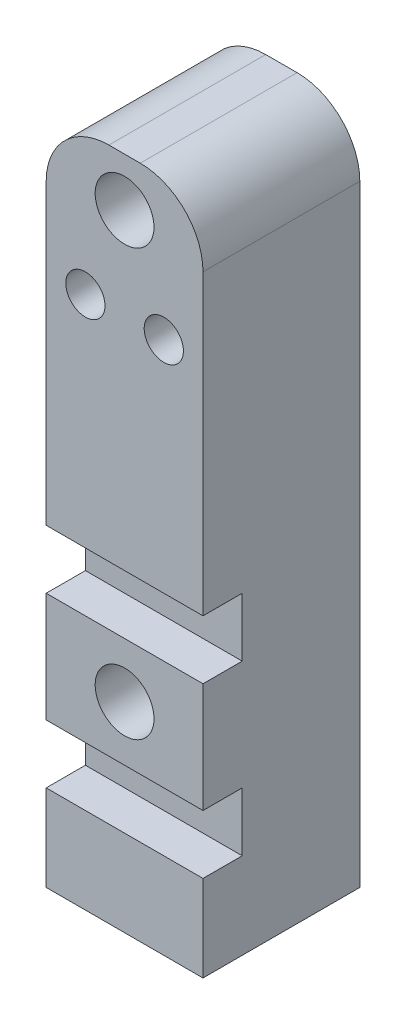
ISO-10303-21;
HEADER;
FILE_DESCRIPTION(('STEP AP214'),'2;1');
FILE_NAME('part.step','',(''),(''),'','','');
FILE_SCHEMA(('AUTOMOTIVE_DESIGN { 1 0 10303 214 1 1 1 1 }'));
ENDSEC;
DATA;
#1=APPLICATION_CONTEXT('core data for automotive mechanical design processes');
#2=APPLICATION_PROTOCOL_DEFINITION('international standard','automotive_design',2000,#1);
#3=PRODUCT_CONTEXT('',#1,'mechanical');
#4=PRODUCT('Part','Part','',(#3));
#5=PRODUCT_RELATED_PRODUCT_CATEGORY('part','',(#4));
#6=PRODUCT_DEFINITION_FORMATION('','',#4);
#7=PRODUCT_DEFINITION_CONTEXT('part definition',#1,'design');
#8=PRODUCT_DEFINITION('design','',#6,#7);
#9=PRODUCT_DEFINITION_SHAPE('','',#8);
#10=(LENGTH_UNIT() NAMED_UNIT(*) SI_UNIT(.MILLI.,.METRE.));
#11=(NAMED_UNIT(*) PLANE_ANGLE_UNIT() SI_UNIT($,.RADIAN.));
#12=(NAMED_UNIT(*) SI_UNIT($,.STERADIAN.) SOLID_ANGLE_UNIT());
#13=UNCERTAINTY_MEASURE_WITH_UNIT(LENGTH_MEASURE(1.E-05),#10,'distance_accuracy_value','');
#14=(GEOMETRIC_REPRESENTATION_CONTEXT(3) GLOBAL_UNCERTAINTY_ASSIGNED_CONTEXT((#13)) GLOBAL_UNIT_ASSIGNED_CONTEXT((#10,
#11,#12)) REPRESENTATION_CONTEXT('',''));
#15=CARTESIAN_POINT('',(0.,0.,0.));
#16=DIRECTION('',(0.,0.,1.));
#17=DIRECTION('',(1.,0.,0.));
#18=AXIS2_PLACEMENT_3D('',#15,#16,#17);
#19=CARTESIAN_POINT('',(12.7,0.,12.7));
#20=DIRECTION('',(0.,0.,-1.));
#21=DIRECTION('',(-1.,0.,0.));
#22=AXIS2_PLACEMENT_3D('',#19,#20,#21);
#23=PLANE('',#22);
#24=DIRECTION('',(0.,-1.,0.));
#25=VECTOR('',#24,1.);
#26=CARTESIAN_POINT('',(-12.7,0.,12.7));
#27=LINE('',#26,#25);
#28=CARTESIAN_POINT('',(-12.7,13.97,12.7));
#29=VERTEX_POINT('',#28);
#30=CARTESIAN_POINT('',(-12.7,0.,12.7));
#31=VERTEX_POINT('',#30);
#32=EDGE_CURVE('E182',#29,#31,#27,.T.);
#33=ORIENTED_EDGE('',*,*,#32,.T.);
#34=DIRECTION('',(-1.,0.,0.));
#35=VECTOR('',#34,1.);
#36=CARTESIAN_POINT('',(12.7,0.,12.7));
#37=LINE('',#36,#35);
#38=CARTESIAN_POINT('',(12.7,0.,12.7));
#39=VERTEX_POINT('',#38);
#40=EDGE_CURVE('E162',#39,#31,#37,.T.);
#41=ORIENTED_EDGE('',*,*,#40,.F.);
#42=DIRECTION('',(0.,-1.,0.));
#43=VECTOR('',#42,1.);
#44=CARTESIAN_POINT('',(12.7,0.,12.7));
#45=LINE('',#44,#43);
#46=CARTESIAN_POINT('',(12.7,13.97,12.7));
#47=VERTEX_POINT('',#46);
#48=EDGE_CURVE('E169',#47,#39,#45,.T.);
#49=ORIENTED_EDGE('',*,*,#48,.F.);
#50=DIRECTION('',(-1.,0.,0.));
#51=VECTOR('',#50,1.);
#52=CARTESIAN_POINT('',(12.7,13.97,12.7));
#53=LINE('',#52,#51);
#54=EDGE_CURVE('E259',#47,#29,#53,.T.);
#55=ORIENTED_EDGE('',*,*,#54,.T.);
#56=EDGE_LOOP('',(#33,#41,#49,#55));
#57=FACE_BOUND('',#56,.T.);
#58=ADVANCED_FACE('F52',(#57),#23,.F.);
#59=CARTESIAN_POINT('',(12.7,0.,12.7));
#60=DIRECTION('',(0.,1.,0.));
#61=DIRECTION('',(0.,0.,1.));
#62=AXIS2_PLACEMENT_3D('',#59,#60,#61);
#63=PLANE('',#62);
#64=CARTESIAN_POINT('',(0.,0.,0.));
#65=DIRECTION('',(0.,-1.,0.));
#66=DIRECTION('',(0.,0.,-1.));
#67=AXIS2_PLACEMENT_3D('',#64,#65,#66);
#68=CIRCLE('',#67,3.175);
#69=CARTESIAN_POINT('',(0.,0.,-3.175));
#70=VERTEX_POINT('',#69);
#71=EDGE_CURVE('E454',#70,#70,#68,.T.);
#72=ORIENTED_EDGE('',*,*,#71,.F.);
#73=EDGE_LOOP('',(#72));
#74=FACE_BOUND('',#73,.T.);
#75=DIRECTION('',(0.,0.,-1.));
#76=VECTOR('',#75,1.);
#77=CARTESIAN_POINT('',(-12.7,0.,12.7));
#78=LINE('',#77,#76);
#79=CARTESIAN_POINT('',(-12.7,0.,-12.7));
#80=VERTEX_POINT('',#79);
#81=EDGE_CURVE('E239',#31,#80,#78,.T.);
#82=ORIENTED_EDGE('',*,*,#81,.T.);
#83=DIRECTION('',(-1.,0.,0.));
#84=VECTOR('',#83,1.);
#85=CARTESIAN_POINT('',(12.7,0.,-12.7));
#86=LINE('',#85,#84);
#87=CARTESIAN_POINT('',(12.7,0.,-12.7));
#88=VERTEX_POINT('',#87);
#89=EDGE_CURVE('E165',#88,#80,#86,.T.);
#90=ORIENTED_EDGE('',*,*,#89,.F.);
#91=DIRECTION('',(0.,0.,-1.));
#92=VECTOR('',#91,1.);
#93=CARTESIAN_POINT('',(12.7,0.,12.7));
#94=LINE('',#93,#92);
#95=EDGE_CURVE('E158',#39,#88,#94,.T.);
#96=ORIENTED_EDGE('',*,*,#95,.F.);
#97=ORIENTED_EDGE('',*,*,#40,.T.);
#98=EDGE_LOOP('',(#82,#90,#96,#97));
#99=FACE_BOUND('',#98,.T.);
#100=ADVANCED_FACE('F160',(#74,#99),#63,.F.);
#101=CARTESIAN_POINT('',(12.7,0.,-12.7));
#102=DIRECTION('',(0.,0.,1.));
#103=DIRECTION('',(1.,0.,0.));
#104=AXIS2_PLACEMENT_3D('',#101,#102,#103);
#105=PLANE('',#104);
#106=CARTESIAN_POINT('',(-6.34999999999998,86.36,-12.7));
#107=DIRECTION('',(0.,0.,1.));
#108=DIRECTION('',(1.,0.,0.));
#109=AXIS2_PLACEMENT_3D('',#106,#107,#108);
#110=CIRCLE('',#109,3.175);
#111=CARTESIAN_POINT('',(-3.17499999999998,86.36,-12.7));
#112=VERTEX_POINT('',#111);
#113=EDGE_CURVE('E470',#112,#112,#110,.T.);
#114=ORIENTED_EDGE('',*,*,#113,.T.);
#115=EDGE_LOOP('',(#114));
#116=FACE_BOUND('',#115,.T.);
#117=CARTESIAN_POINT('',(6.35,86.36,-12.7));
#118=DIRECTION('',(0.,0.,1.));
#119=DIRECTION('',(1.,0.,0.));
#120=AXIS2_PLACEMENT_3D('',#117,#118,#119);
#121=CIRCLE('',#120,3.175);
#122=CARTESIAN_POINT('',(9.52500000000001,86.36,-12.7));
#123=VERTEX_POINT('',#122);
#124=EDGE_CURVE('E479',#123,#123,#121,.T.);
#125=ORIENTED_EDGE('',*,*,#124,.T.);
#126=EDGE_LOOP('',(#125));
#127=FACE_BOUND('',#126,.T.);
#128=CARTESIAN_POINT('',(0.,32.385,-12.7));
#129=DIRECTION('',(0.,0.,1.));
#130=DIRECTION('',(1.,0.,0.));
#131=AXIS2_PLACEMENT_3D('',#128,#129,#130);
#132=CIRCLE('',#131,4.7625);
#133=CARTESIAN_POINT('',(4.7625,32.385,-12.7));
#134=VERTEX_POINT('',#133);
#135=EDGE_CURVE('E346',#134,#134,#132,.T.);
#136=ORIENTED_EDGE('',*,*,#135,.T.);
#137=EDGE_LOOP('',(#136));
#138=FACE_BOUND('',#137,.T.);
#139=DIRECTION('',(0.,1.,0.));
#140=VECTOR('',#139,1.);
#141=CARTESIAN_POINT('',(-12.7,0.,-12.7));
#142=LINE('',#141,#140);
#143=CARTESIAN_POINT('',(-12.7,99.06,-12.7));
#144=VERTEX_POINT('',#143);
#145=EDGE_CURVE('E212',#80,#144,#142,.T.);
#146=ORIENTED_EDGE('',*,*,#145,.T.);
#147=CARTESIAN_POINT('',(-2.54,99.06,-12.7));
#148=DIRECTION('',(0.,0.,1.));
#149=DIRECTION('',(1.,0.,0.));
#150=AXIS2_PLACEMENT_3D('',#147,#148,#149);
#151=CIRCLE('',#150,10.16);
#152=CARTESIAN_POINT('',(-2.54,109.22,-12.7));
#153=VERTEX_POINT('',#152);
#154=EDGE_CURVE('E61',#144,#153,#151,.F.);
#155=ORIENTED_EDGE('',*,*,#154,.T.);
#156=DIRECTION('',(-1.,0.,0.));
#157=VECTOR('',#156,1.);
#158=CARTESIAN_POINT('',(12.7,109.22,-12.7));
#159=LINE('',#158,#157);
#160=CARTESIAN_POINT('',(2.54,109.22,-12.7));
#161=VERTEX_POINT('',#160);
#162=EDGE_CURVE('E191',#161,#153,#159,.T.);
#163=ORIENTED_EDGE('',*,*,#162,.F.);
#164=CARTESIAN_POINT('',(2.54,99.06,-12.7));
#165=DIRECTION('',(0.,0.,1.));
#166=DIRECTION('',(1.,0.,0.));
#167=AXIS2_PLACEMENT_3D('',#164,#165,#166);
#168=CIRCLE('',#167,10.16);
#169=CARTESIAN_POINT('',(12.7,99.06,-12.7));
#170=VERTEX_POINT('',#169);
#171=EDGE_CURVE('E68',#161,#170,#168,.F.);
#172=ORIENTED_EDGE('',*,*,#171,.T.);
#173=DIRECTION('',(0.,1.,0.));
#174=VECTOR('',#173,1.);
#175=CARTESIAN_POINT('',(12.7,0.,-12.7));
#176=LINE('',#175,#174);
#177=EDGE_CURVE('E168',#88,#170,#176,.T.);
#178=ORIENTED_EDGE('',*,*,#177,.F.);
#179=ORIENTED_EDGE('',*,*,#89,.T.);
#180=EDGE_LOOP('',(#146,#155,#163,#172,#178,#179));
#181=FACE_BOUND('',#180,.T.);
#182=ADVANCED_FACE('F211',(#116,#127,#138,#181),#105,.F.);
#183=CARTESIAN_POINT('',(12.7,109.22,-12.7));
#184=DIRECTION('',(0.,-1.,0.));
#185=DIRECTION('',(0.,0.,-1.));
#186=AXIS2_PLACEMENT_3D('',#183,#184,#185);
#187=PLANE('',#186);
#188=ORIENTED_EDGE('',*,*,#162,.T.);
#189=DIRECTION('',(0.,0.,1.));
#190=VECTOR('',#189,1.);
#191=CARTESIAN_POINT('',(-2.54,109.22,12.7));
#192=LINE('',#191,#190);
#193=CARTESIAN_POINT('',(-2.54,109.22,12.7));
#194=VERTEX_POINT('',#193);
#195=EDGE_CURVE('E189',#153,#194,#192,.T.);
#196=ORIENTED_EDGE('',*,*,#195,.T.);
#197=DIRECTION('',(-1.,0.,0.));
#198=VECTOR('',#197,1.);
#199=CARTESIAN_POINT('',(12.7,109.22,12.7));
#200=LINE('',#199,#198);
#201=CARTESIAN_POINT('',(2.54,109.22,12.7));
#202=VERTEX_POINT('',#201);
#203=EDGE_CURVE('E221',#202,#194,#200,.T.);
#204=ORIENTED_EDGE('',*,*,#203,.F.);
#205=DIRECTION('',(0.,0.,1.));
#206=VECTOR('',#205,1.);
#207=CARTESIAN_POINT('',(2.54,109.22,-12.7));
#208=LINE('',#207,#206);
#209=EDGE_CURVE('E184',#202,#161,#208,.F.);
#210=ORIENTED_EDGE('',*,*,#209,.T.);
#211=EDGE_LOOP('',(#188,#196,#204,#210));
#212=FACE_BOUND('',#211,.T.);
#213=ADVANCED_FACE('F216',(#212),#187,.F.);
#214=CARTESIAN_POINT('',(12.7,50.8,12.7));
#215=DIRECTION('',(0.,0.,-1.));
#216=DIRECTION('',(-1.,0.,0.));
#217=AXIS2_PLACEMENT_3D('',#214,#215,#216);
#218=PLANE('',#217);
#219=CARTESIAN_POINT('',(0.,101.346,12.7));
#220=DIRECTION('',(0.,0.,1.));
#221=DIRECTION('',(1.,0.,0.));
#222=AXIS2_PLACEMENT_3D('',#219,#220,#221);
#223=CIRCLE('',#222,4.7625);
#224=CARTESIAN_POINT('',(4.7625,101.346,12.7));
#225=VERTEX_POINT('',#224);
#226=EDGE_CURVE('E455',#225,#225,#223,.T.);
#227=ORIENTED_EDGE('',*,*,#226,.F.);
#228=EDGE_LOOP('',(#227));
#229=FACE_BOUND('',#228,.T.);
#230=CARTESIAN_POINT('',(-6.34999999999998,86.36,12.7));
#231=DIRECTION('',(0.,0.,1.));
#232=DIRECTION('',(1.,0.,0.));
#233=AXIS2_PLACEMENT_3D('',#230,#231,#232);
#234=CIRCLE('',#233,3.175);
#235=CARTESIAN_POINT('',(-3.17499999999998,86.36,12.7));
#236=VERTEX_POINT('',#235);
#237=EDGE_CURVE('E475',#236,#236,#234,.T.);
#238=ORIENTED_EDGE('',*,*,#237,.F.);
#239=EDGE_LOOP('',(#238));
#240=FACE_BOUND('',#239,.T.);
#241=CARTESIAN_POINT('',(6.35,86.36,12.7));
#242=DIRECTION('',(0.,0.,1.));
#243=DIRECTION('',(1.,0.,0.));
#244=AXIS2_PLACEMENT_3D('',#241,#242,#243);
#245=CIRCLE('',#244,3.175);
#246=CARTESIAN_POINT('',(9.52500000000001,86.36,12.7));
#247=VERTEX_POINT('',#246);
#248=EDGE_CURVE('E468',#247,#247,#245,.T.);
#249=ORIENTED_EDGE('',*,*,#248,.F.);
#250=EDGE_LOOP('',(#249));
#251=FACE_BOUND('',#250,.T.);
#252=ORIENTED_EDGE('',*,*,#203,.T.);
#253=CARTESIAN_POINT('',(-2.54,99.06,12.7));
#254=DIRECTION('',(0.,0.,-1.));
#255=DIRECTION('',(-1.,0.,0.));
#256=AXIS2_PLACEMENT_3D('',#253,#254,#255);
#257=CIRCLE('',#256,10.16);
#258=CARTESIAN_POINT('',(-12.7,99.06,12.7));
#259=VERTEX_POINT('',#258);
#260=EDGE_CURVE('E201',#194,#259,#257,.F.);
#261=ORIENTED_EDGE('',*,*,#260,.T.);
#262=DIRECTION('',(0.,-1.,0.));
#263=VECTOR('',#262,1.);
#264=CARTESIAN_POINT('',(-12.7,50.8,12.7));
#265=LINE('',#264,#263);
#266=CARTESIAN_POINT('',(-12.7,50.8,12.7));
#267=VERTEX_POINT('',#266);
#268=EDGE_CURVE('E226',#259,#267,#265,.T.);
#269=ORIENTED_EDGE('',*,*,#268,.T.);
#270=DIRECTION('',(-1.,0.,0.));
#271=VECTOR('',#270,1.);
#272=CARTESIAN_POINT('',(12.7,50.8,12.7));
#273=LINE('',#272,#271);
#274=CARTESIAN_POINT('',(12.7,50.8,12.7));
#275=VERTEX_POINT('',#274);
#276=EDGE_CURVE('E286',#275,#267,#273,.T.);
#277=ORIENTED_EDGE('',*,*,#276,.F.);
#278=DIRECTION('',(0.,-1.,0.));
#279=VECTOR('',#278,1.);
#280=CARTESIAN_POINT('',(12.7,50.8,12.7));
#281=LINE('',#280,#279);
#282=CARTESIAN_POINT('',(12.7,99.06,12.7));
#283=VERTEX_POINT('',#282);
#284=EDGE_CURVE('E327',#283,#275,#281,.T.);
#285=ORIENTED_EDGE('',*,*,#284,.F.);
#286=CARTESIAN_POINT('',(2.54,99.06,12.7));
#287=DIRECTION('',(0.,0.,-1.));
#288=DIRECTION('',(-1.,0.,0.));
#289=AXIS2_PLACEMENT_3D('',#286,#287,#288);
#290=CIRCLE('',#289,10.16);
#291=EDGE_CURVE('E198',#283,#202,#290,.F.);
#292=ORIENTED_EDGE('',*,*,#291,.T.);
#293=EDGE_LOOP('',(#252,#261,#269,#277,#285,#292));
#294=FACE_BOUND('',#293,.T.);
#295=ADVANCED_FACE('F224',(#229,#240,#251,#294),#218,.F.);
#296=CARTESIAN_POINT('',(12.7,50.8,12.7));
#297=DIRECTION('',(0.,1.,0.));
#298=DIRECTION('',(0.,0.,1.));
#299=AXIS2_PLACEMENT_3D('',#296,#297,#298);
#300=PLANE('',#299);
#301=DIRECTION('',(0.,0.,-1.));
#302=VECTOR('',#301,1.);
#303=CARTESIAN_POINT('',(-12.7,50.8,12.7));
#304=LINE('',#303,#302);
#305=CARTESIAN_POINT('',(-12.7,50.8,6.35));
#306=VERTEX_POINT('',#305);
#307=EDGE_CURVE('E231',#267,#306,#304,.T.);
#308=ORIENTED_EDGE('',*,*,#307,.T.);
#309=DIRECTION('',(-1.,0.,0.));
#310=VECTOR('',#309,1.);
#311=CARTESIAN_POINT('',(12.7,50.8,6.35));
#312=LINE('',#311,#310);
#313=CARTESIAN_POINT('',(12.7,50.8,6.35));
#314=VERTEX_POINT('',#313);
#315=EDGE_CURVE('E282',#314,#306,#312,.T.);
#316=ORIENTED_EDGE('',*,*,#315,.F.);
#317=DIRECTION('',(0.,0.,-1.));
#318=VECTOR('',#317,1.);
#319=CARTESIAN_POINT('',(12.7,50.8,12.7));
#320=LINE('',#319,#318);
#321=EDGE_CURVE('E323',#275,#314,#320,.T.);
#322=ORIENTED_EDGE('',*,*,#321,.F.);
#323=ORIENTED_EDGE('',*,*,#276,.T.);
#324=EDGE_LOOP('',(#308,#316,#322,#323));
#325=FACE_BOUND('',#324,.T.);
#326=ADVANCED_FACE('F379',(#325),#300,.F.);
#327=CARTESIAN_POINT('',(12.7,50.8,6.35));
#328=DIRECTION('',(0.,0.,-1.));
#329=DIRECTION('',(0.,1.,0.));
#330=AXIS2_PLACEMENT_3D('',#327,#328,#329);
#331=PLANE('',#330);
#332=DIRECTION('',(0.,-1.,0.));
#333=VECTOR('',#332,1.);
#334=CARTESIAN_POINT('',(-12.7,50.8,6.35));
#335=LINE('',#334,#333);
#336=CARTESIAN_POINT('',(-12.7,41.275,6.34999999999999));
#337=VERTEX_POINT('',#336);
#338=EDGE_CURVE('E237',#306,#337,#335,.T.);
#339=ORIENTED_EDGE('',*,*,#338,.T.);
#340=DIRECTION('',(-1.,0.,0.));
#341=VECTOR('',#340,1.);
#342=CARTESIAN_POINT('',(12.7,41.275,6.34999999999999));
#343=LINE('',#342,#341);
#344=CARTESIAN_POINT('',(12.7,41.275,6.34999999999999));
#345=VERTEX_POINT('',#344);
#346=EDGE_CURVE('E278',#345,#337,#343,.T.);
#347=ORIENTED_EDGE('',*,*,#346,.F.);
#348=DIRECTION('',(0.,-1.,0.));
#349=VECTOR('',#348,1.);
#350=CARTESIAN_POINT('',(12.7,50.8,6.35));
#351=LINE('',#350,#349);
#352=EDGE_CURVE('E319',#314,#345,#351,.T.);
#353=ORIENTED_EDGE('',*,*,#352,.F.);
#354=ORIENTED_EDGE('',*,*,#315,.T.);
#355=EDGE_LOOP('',(#339,#347,#353,#354));
#356=FACE_BOUND('',#355,.T.);
#357=ADVANCED_FACE('F375',(#356),#331,.F.);
#358=CARTESIAN_POINT('',(12.7,41.275,12.7));
#359=DIRECTION('',(0.,-1.,0.));
#360=DIRECTION('',(0.,0.,-1.));
#361=AXIS2_PLACEMENT_3D('',#358,#359,#360);
#362=PLANE('',#361);
#363=DIRECTION('',(0.,0.,1.));
#364=VECTOR('',#363,1.);
#365=CARTESIAN_POINT('',(-12.7,41.275,12.7));
#366=LINE('',#365,#364);
#367=CARTESIAN_POINT('',(-12.7,41.275,12.7));
#368=VERTEX_POINT('',#367);
#369=EDGE_CURVE('E245',#337,#368,#366,.T.);
#370=ORIENTED_EDGE('',*,*,#369,.T.);
#371=DIRECTION('',(-1.,0.,0.));
#372=VECTOR('',#371,1.);
#373=CARTESIAN_POINT('',(12.7,41.275,12.7));
#374=LINE('',#373,#372);
#375=CARTESIAN_POINT('',(12.7,41.275,12.7));
#376=VERTEX_POINT('',#375);
#377=EDGE_CURVE('E274',#376,#368,#374,.T.);
#378=ORIENTED_EDGE('',*,*,#377,.F.);
#379=DIRECTION('',(0.,0.,1.));
#380=VECTOR('',#379,1.);
#381=CARTESIAN_POINT('',(12.7,41.275,12.7));
#382=LINE('',#381,#380);
#383=EDGE_CURVE('E315',#345,#376,#382,.T.);
#384=ORIENTED_EDGE('',*,*,#383,.F.);
#385=ORIENTED_EDGE('',*,*,#346,.T.);
#386=EDGE_LOOP('',(#370,#378,#384,#385));
#387=FACE_BOUND('',#386,.T.);
#388=ADVANCED_FACE('F371',(#387),#362,.F.);
#389=CARTESIAN_POINT('',(12.7,23.495,12.7));
#390=DIRECTION('',(0.,0.,-1.));
#391=DIRECTION('',(-1.,0.,0.));
#392=AXIS2_PLACEMENT_3D('',#389,#390,#391);
#393=PLANE('',#392);
#394=CARTESIAN_POINT('',(0.,32.385,12.7));
#395=DIRECTION('',(0.,0.,1.));
#396=DIRECTION('',(1.,0.,0.));
#397=AXIS2_PLACEMENT_3D('',#394,#395,#396);
#398=CIRCLE('',#397,4.7625);
#399=CARTESIAN_POINT('',(4.7625,32.385,12.7));
#400=VERTEX_POINT('',#399);
#401=EDGE_CURVE('E474',#400,#400,#398,.T.);
#402=ORIENTED_EDGE('',*,*,#401,.F.);
#403=EDGE_LOOP('',(#402));
#404=FACE_BOUND('',#403,.T.);
#405=DIRECTION('',(0.,-1.,0.));
#406=VECTOR('',#405,1.);
#407=CARTESIAN_POINT('',(-12.7,23.495,12.7));
#408=LINE('',#407,#406);
#409=CARTESIAN_POINT('',(-12.7,23.495,12.7));
#410=VERTEX_POINT('',#409);
#411=EDGE_CURVE('E248',#368,#410,#408,.T.);
#412=ORIENTED_EDGE('',*,*,#411,.T.);
#413=DIRECTION('',(-1.,0.,0.));
#414=VECTOR('',#413,1.);
#415=CARTESIAN_POINT('',(12.7,23.495,12.7));
#416=LINE('',#415,#414);
#417=CARTESIAN_POINT('',(12.7,23.495,12.7));
#418=VERTEX_POINT('',#417);
#419=EDGE_CURVE('E270',#418,#410,#416,.T.);
#420=ORIENTED_EDGE('',*,*,#419,.F.);
#421=DIRECTION('',(0.,-1.,0.));
#422=VECTOR('',#421,1.);
#423=CARTESIAN_POINT('',(12.7,23.495,12.7));
#424=LINE('',#423,#422);
#425=EDGE_CURVE('E311',#376,#418,#424,.T.);
#426=ORIENTED_EDGE('',*,*,#425,.F.);
#427=ORIENTED_EDGE('',*,*,#377,.T.);
#428=EDGE_LOOP('',(#412,#420,#426,#427));
#429=FACE_BOUND('',#428,.T.);
#430=ADVANCED_FACE('F366',(#404,#429),#393,.F.);
#431=CARTESIAN_POINT('',(12.7,23.495,12.7));
#432=DIRECTION('',(0.,1.,0.));
#433=DIRECTION('',(0.,0.,1.));
#434=AXIS2_PLACEMENT_3D('',#431,#432,#433);
#435=PLANE('',#434);
#436=DIRECTION('',(0.,0.,-1.));
#437=VECTOR('',#436,1.);
#438=CARTESIAN_POINT('',(-12.7,23.495,12.7));
#439=LINE('',#438,#437);
#440=CARTESIAN_POINT('',(-12.7,23.495,6.34999999999999));
#441=VERTEX_POINT('',#440);
#442=EDGE_CURVE('E251',#410,#441,#439,.T.);
#443=ORIENTED_EDGE('',*,*,#442,.T.);
#444=DIRECTION('',(-1.,0.,0.));
#445=VECTOR('',#444,1.);
#446=CARTESIAN_POINT('',(12.7,23.495,6.34999999999999));
#447=LINE('',#446,#445);
#448=CARTESIAN_POINT('',(12.7,23.495,6.34999999999999));
#449=VERTEX_POINT('',#448);
#450=EDGE_CURVE('E266',#449,#441,#447,.T.);
#451=ORIENTED_EDGE('',*,*,#450,.F.);
#452=DIRECTION('',(0.,0.,-1.));
#453=VECTOR('',#452,1.);
#454=CARTESIAN_POINT('',(12.7,23.495,12.7));
#455=LINE('',#454,#453);
#456=EDGE_CURVE('E307',#418,#449,#455,.T.);
#457=ORIENTED_EDGE('',*,*,#456,.F.);
#458=ORIENTED_EDGE('',*,*,#419,.T.);
#459=EDGE_LOOP('',(#443,#451,#457,#458));
#460=FACE_BOUND('',#459,.T.);
#461=ADVANCED_FACE('F361',(#460),#435,.F.);
#462=CARTESIAN_POINT('',(12.7,23.495,6.34999999999999));
#463=DIRECTION('',(0.,0.,-1.));
#464=DIRECTION('',(0.,1.,0.));
#465=AXIS2_PLACEMENT_3D('',#462,#463,#464);
#466=PLANE('',#465);
#467=DIRECTION('',(0.,-1.,0.));
#468=VECTOR('',#467,1.);
#469=CARTESIAN_POINT('',(-12.7,23.495,6.34999999999999));
#470=LINE('',#469,#468);
#471=CARTESIAN_POINT('',(-12.7,13.97,6.34999999999999));
#472=VERTEX_POINT('',#471);
#473=EDGE_CURVE('E254',#441,#472,#470,.T.);
#474=ORIENTED_EDGE('',*,*,#473,.T.);
#475=DIRECTION('',(-1.,0.,0.));
#476=VECTOR('',#475,1.);
#477=CARTESIAN_POINT('',(12.7,13.97,6.34999999999999));
#478=LINE('',#477,#476);
#479=CARTESIAN_POINT('',(12.7,13.97,6.34999999999999));
#480=VERTEX_POINT('',#479);
#481=EDGE_CURVE('E262',#480,#472,#478,.T.);
#482=ORIENTED_EDGE('',*,*,#481,.F.);
#483=DIRECTION('',(0.,-1.,0.));
#484=VECTOR('',#483,1.);
#485=CARTESIAN_POINT('',(12.7,23.495,6.34999999999999));
#486=LINE('',#485,#484);
#487=EDGE_CURVE('E303',#449,#480,#486,.T.);
#488=ORIENTED_EDGE('',*,*,#487,.F.);
#489=ORIENTED_EDGE('',*,*,#450,.T.);
#490=EDGE_LOOP('',(#474,#482,#488,#489));
#491=FACE_BOUND('',#490,.T.);
#492=ADVANCED_FACE('F357',(#491),#466,.F.);
#493=CARTESIAN_POINT('',(12.7,13.97,12.7));
#494=DIRECTION('',(0.,-1.,0.));
#495=DIRECTION('',(0.,0.,-1.));
#496=AXIS2_PLACEMENT_3D('',#493,#494,#495);
#497=PLANE('',#496);
#498=DIRECTION('',(0.,0.,1.));
#499=VECTOR('',#498,1.);
#500=CARTESIAN_POINT('',(-12.7,13.97,12.7));
#501=LINE('',#500,#499);
#502=EDGE_CURVE('E179',#472,#29,#501,.T.);
#503=ORIENTED_EDGE('',*,*,#502,.T.);
#504=ORIENTED_EDGE('',*,*,#54,.F.);
#505=DIRECTION('',(0.,0.,1.));
#506=VECTOR('',#505,1.);
#507=CARTESIAN_POINT('',(12.7,13.97,12.7));
#508=LINE('',#507,#506);
#509=EDGE_CURVE('E174',#480,#47,#508,.T.);
#510=ORIENTED_EDGE('',*,*,#509,.F.);
#511=ORIENTED_EDGE('',*,*,#481,.T.);
#512=EDGE_LOOP('',(#503,#504,#510,#511));
#513=FACE_BOUND('',#512,.T.);
#514=ADVANCED_FACE('F353',(#513),#497,.F.);
#515=CARTESIAN_POINT('',(12.7,0.,0.));
#516=DIRECTION('',(-1.,0.,0.));
#517=DIRECTION('',(0.,0.,1.));
#518=AXIS2_PLACEMENT_3D('',#515,#516,#517);
#519=PLANE('',#518);
#520=ORIENTED_EDGE('',*,*,#177,.T.);
#521=DIRECTION('',(0.,0.,1.));
#522=VECTOR('',#521,1.);
#523=CARTESIAN_POINT('',(12.7,99.06,0.));
#524=LINE('',#523,#522);
#525=EDGE_CURVE('E13',#170,#283,#524,.T.);
#526=ORIENTED_EDGE('',*,*,#525,.T.);
#527=ORIENTED_EDGE('',*,*,#284,.T.);
#528=ORIENTED_EDGE('',*,*,#321,.T.);
#529=ORIENTED_EDGE('',*,*,#352,.T.);
#530=ORIENTED_EDGE('',*,*,#383,.T.);
#531=ORIENTED_EDGE('',*,*,#425,.T.);
#532=ORIENTED_EDGE('',*,*,#456,.T.);
#533=ORIENTED_EDGE('',*,*,#487,.T.);
#534=ORIENTED_EDGE('',*,*,#509,.T.);
#535=ORIENTED_EDGE('',*,*,#48,.T.);
#536=ORIENTED_EDGE('',*,*,#95,.T.);
#537=EDGE_LOOP('',(#520,#526,#527,#528,#529,#530,#531,#532,#533,#534,#535,#536));
#538=FACE_BOUND('',#537,.T.);
#539=ADVANCED_FACE('F172',(#538),#519,.F.);
#540=CARTESIAN_POINT('',(-12.7,0.,0.));
#541=DIRECTION('',(-1.,0.,0.));
#542=DIRECTION('',(0.,0.,1.));
#543=AXIS2_PLACEMENT_3D('',#540,#541,#542);
#544=PLANE('',#543);
#545=ORIENTED_EDGE('',*,*,#268,.F.);
#546=DIRECTION('',(0.,0.,1.));
#547=VECTOR('',#546,1.);
#548=CARTESIAN_POINT('',(-12.7,99.06,-12.7));
#549=LINE('',#548,#547);
#550=EDGE_CURVE('E76',#259,#144,#549,.F.);
#551=ORIENTED_EDGE('',*,*,#550,.T.);
#552=ORIENTED_EDGE('',*,*,#145,.F.);
#553=ORIENTED_EDGE('',*,*,#81,.F.);
#554=ORIENTED_EDGE('',*,*,#32,.F.);
#555=ORIENTED_EDGE('',*,*,#502,.F.);
#556=ORIENTED_EDGE('',*,*,#473,.F.);
#557=ORIENTED_EDGE('',*,*,#442,.F.);
#558=ORIENTED_EDGE('',*,*,#411,.F.);
#559=ORIENTED_EDGE('',*,*,#369,.F.);
#560=ORIENTED_EDGE('',*,*,#338,.F.);
#561=ORIENTED_EDGE('',*,*,#307,.F.);
#562=EDGE_LOOP('',(#545,#551,#552,#553,#554,#555,#556,#557,#558,#559,#560,#561));
#563=FACE_BOUND('',#562,.T.);
#564=ADVANCED_FACE('F229',(#563),#544,.T.);
#565=CARTESIAN_POINT('',(0.,32.385,-12.7));
#566=DIRECTION('',(0.,0.,1.));
#567=DIRECTION('',(1.,0.,0.));
#568=AXIS2_PLACEMENT_3D('',#565,#566,#567);
#569=CYLINDRICAL_SURFACE('',#568,4.7625);
#570=ORIENTED_EDGE('',*,*,#135,.F.);
#571=EDGE_LOOP('',(#570));
#572=FACE_BOUND('',#571,.T.);
#573=ORIENTED_EDGE('',*,*,#401,.T.);
#574=EDGE_LOOP('',(#573));
#575=FACE_BOUND('',#574,.T.);
#576=ADVANCED_FACE('F391',(#572,#575),#569,.F.);
#577=CARTESIAN_POINT('',(-2.54,99.06,-12.7));
#578=DIRECTION('',(0.,0.,-1.));
#579=DIRECTION('',(-1.,0.,0.));
#580=AXIS2_PLACEMENT_3D('',#577,#578,#579);
#581=CYLINDRICAL_SURFACE('',#580,10.16);
#582=ORIENTED_EDGE('',*,*,#154,.F.);
#583=ORIENTED_EDGE('',*,*,#550,.F.);
#584=ORIENTED_EDGE('',*,*,#260,.F.);
#585=ORIENTED_EDGE('',*,*,#195,.F.);
#586=EDGE_LOOP('',(#582,#583,#584,#585));
#587=FACE_BOUND('',#586,.T.);
#588=ADVANCED_FACE('F222',(#587),#581,.T.);
#589=CARTESIAN_POINT('',(2.54,99.06,0.));
#590=DIRECTION('',(0.,0.,1.));
#591=DIRECTION('',(1.,0.,0.));
#592=AXIS2_PLACEMENT_3D('',#589,#590,#591);
#593=CYLINDRICAL_SURFACE('',#592,10.16);
#594=ORIENTED_EDGE('',*,*,#171,.F.);
#595=ORIENTED_EDGE('',*,*,#209,.F.);
#596=ORIENTED_EDGE('',*,*,#291,.F.);
#597=ORIENTED_EDGE('',*,*,#525,.F.);
#598=EDGE_LOOP('',(#594,#595,#596,#597));
#599=FACE_BOUND('',#598,.T.);
#600=ADVANCED_FACE('F54',(#599),#593,.T.);
#601=CARTESIAN_POINT('',(6.35,86.36,-12.7));
#602=DIRECTION('',(0.,0.,1.));
#603=DIRECTION('',(1.,0.,0.));
#604=AXIS2_PLACEMENT_3D('',#601,#602,#603);
#605=CYLINDRICAL_SURFACE('',#604,3.175);
#606=ORIENTED_EDGE('',*,*,#124,.F.);
#607=EDGE_LOOP('',(#606));
#608=FACE_BOUND('',#607,.T.);
#609=ORIENTED_EDGE('',*,*,#248,.T.);
#610=EDGE_LOOP('',(#609));
#611=FACE_BOUND('',#610,.T.);
#612=ADVANCED_FACE('F383',(#608,#611),#605,.F.);
#613=CARTESIAN_POINT('',(-6.34999999999998,86.36,-12.7));
#614=DIRECTION('',(0.,0.,1.));
#615=DIRECTION('',(1.,0.,0.));
#616=AXIS2_PLACEMENT_3D('',#613,#614,#615);
#617=CYLINDRICAL_SURFACE('',#616,3.175);
#618=ORIENTED_EDGE('',*,*,#113,.F.);
#619=EDGE_LOOP('',(#618));
#620=FACE_BOUND('',#619,.T.);
#621=ORIENTED_EDGE('',*,*,#237,.T.);
#622=EDGE_LOOP('',(#621));
#623=FACE_BOUND('',#622,.T.);
#624=ADVANCED_FACE('F388',(#620,#623),#617,.F.);
#625=CARTESIAN_POINT('',(0.,17.78,0.));
#626=DIRECTION('',(0.,-1.,0.));
#627=DIRECTION('',(0.,0.,-1.));
#628=AXIS2_PLACEMENT_3D('',#625,#626,#627);
#629=CYLINDRICAL_SURFACE('',#628,3.175);
#630=CARTESIAN_POINT('',(0.,17.78,0.));
#631=DIRECTION('',(0.,-1.,0.));
#632=DIRECTION('',(0.,0.,-1.));
#633=AXIS2_PLACEMENT_3D('',#630,#631,#632);
#634=CIRCLE('',#633,3.175);
#635=CARTESIAN_POINT('',(0.,17.78,-3.175));
#636=VERTEX_POINT('',#635);
#637=EDGE_CURVE('E461',#636,#636,#634,.T.);
#638=ORIENTED_EDGE('',*,*,#637,.F.);
#639=EDGE_LOOP('',(#638));
#640=FACE_BOUND('',#639,.T.);
#641=ORIENTED_EDGE('',*,*,#71,.T.);
#642=EDGE_LOOP('',(#641));
#643=FACE_BOUND('',#642,.T.);
#644=ADVANCED_FACE('F432',(#640,#643),#629,.F.);
#645=CARTESIAN_POINT('',(0.,17.78,0.));
#646=DIRECTION('',(0.,-1.,0.));
#647=DIRECTION('',(0.,0.,-1.));
#648=AXIS2_PLACEMENT_3D('',#645,#646,#647);
#649=PLANE('',#648);
#650=ORIENTED_EDGE('',*,*,#637,.T.);
#651=EDGE_LOOP('',(#650));
#652=FACE_BOUND('',#651,.T.);
#653=ADVANCED_FACE('F436',(#652),#649,.T.);
#654=CARTESIAN_POINT('',(0.,101.346,-3.81));
#655=DIRECTION('',(0.,0.,1.));
#656=DIRECTION('',(1.,0.,0.));
#657=AXIS2_PLACEMENT_3D('',#654,#655,#656);
#658=CYLINDRICAL_SURFACE('',#657,4.7625);
#659=CARTESIAN_POINT('',(0.,101.346,-3.81));
#660=DIRECTION('',(0.,0.,1.));
#661=DIRECTION('',(1.,0.,0.));
#662=AXIS2_PLACEMENT_3D('',#659,#660,#661);
#663=CIRCLE('',#662,4.7625);
#664=CARTESIAN_POINT('',(4.7625,101.346,-3.81));
#665=VERTEX_POINT('',#664);
#666=EDGE_CURVE('E452',#665,#665,#663,.T.);
#667=ORIENTED_EDGE('',*,*,#666,.F.);
#668=EDGE_LOOP('',(#667));
#669=FACE_BOUND('',#668,.T.);
#670=ORIENTED_EDGE('',*,*,#226,.T.);
#671=EDGE_LOOP('',(#670));
#672=FACE_BOUND('',#671,.T.);
#673=ADVANCED_FACE('F440',(#669,#672),#658,.F.);
#674=CARTESIAN_POINT('',(0.,101.346,-3.81));
#675=DIRECTION('',(0.,0.,1.));
#676=DIRECTION('',(1.,0.,0.));
#677=AXIS2_PLACEMENT_3D('',#674,#675,#676);
#678=PLANE('',#677);
#679=ORIENTED_EDGE('',*,*,#666,.T.);
#680=EDGE_LOOP('',(#679));
#681=FACE_BOUND('',#680,.T.);
#682=ADVANCED_FACE('F444',(#681),#678,.T.);
#683=CLOSED_SHELL('',(#58,#100,#182,#213,#295,#326,#357,#388,#430,#461,#492,#514,#539,#564,#576,
#588,#600,#612,#624,#644,#653,#673,#682));
#684=MANIFOLD_SOLID_BREP('B2',#683);
#685=ADVANCED_BREP_SHAPE_REPRESENTATION('',(#18,#684),#14);
#686=SHAPE_DEFINITION_REPRESENTATION(#9,#685);
ENDSEC;
END-ISO-10303-21;
